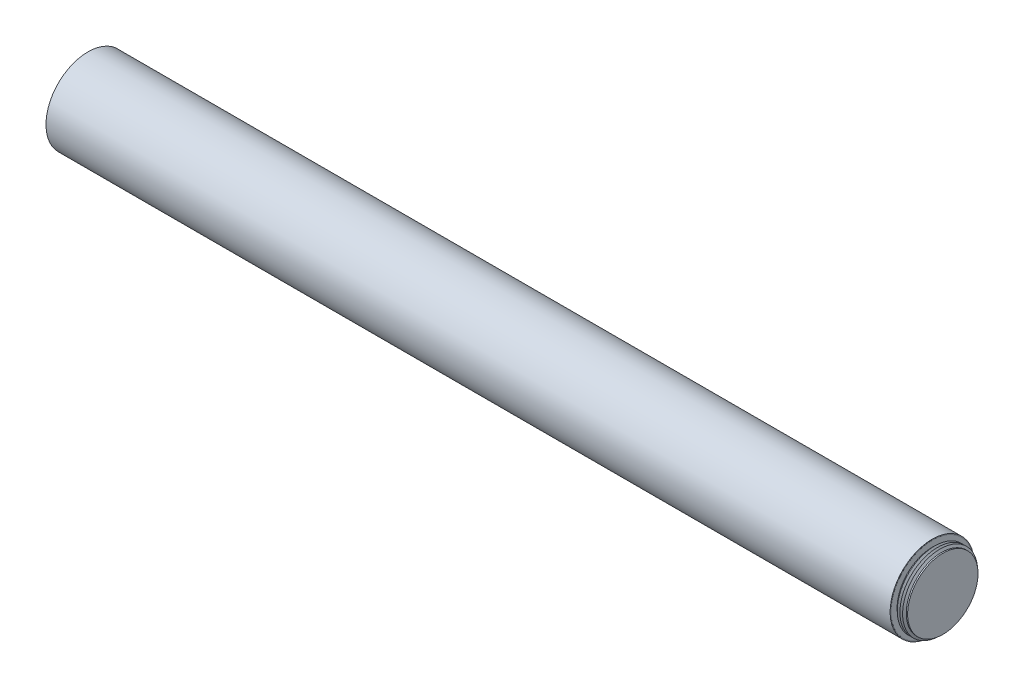
ISO-10303-21;
HEADER;
FILE_DESCRIPTION(('STEP AP214'),'2;1');
FILE_NAME('part.step','',(''),(''),'','','');
FILE_SCHEMA(('AUTOMOTIVE_DESIGN { 1 0 10303 214 1 1 1 1 }'));
ENDSEC;
DATA;
#1=APPLICATION_CONTEXT('core data for automotive mechanical design processes');
#2=APPLICATION_PROTOCOL_DEFINITION('international standard','automotive_design',2000,#1);
#3=PRODUCT_CONTEXT('',#1,'mechanical');
#4=PRODUCT('Part','Part','',(#3));
#5=PRODUCT_RELATED_PRODUCT_CATEGORY('part','',(#4));
#6=PRODUCT_DEFINITION_FORMATION('','',#4);
#7=PRODUCT_DEFINITION_CONTEXT('part definition',#1,'design');
#8=PRODUCT_DEFINITION('design','',#6,#7);
#9=PRODUCT_DEFINITION_SHAPE('','',#8);
#10=(LENGTH_UNIT() NAMED_UNIT(*) SI_UNIT(.MILLI.,.METRE.));
#11=(NAMED_UNIT(*) PLANE_ANGLE_UNIT() SI_UNIT($,.RADIAN.));
#12=(NAMED_UNIT(*) SI_UNIT($,.STERADIAN.) SOLID_ANGLE_UNIT());
#13=UNCERTAINTY_MEASURE_WITH_UNIT(LENGTH_MEASURE(1.E-05),#10,'distance_accuracy_value','');
#14=(GEOMETRIC_REPRESENTATION_CONTEXT(3) GLOBAL_UNCERTAINTY_ASSIGNED_CONTEXT((#13)) GLOBAL_UNIT_ASSIGNED_CONTEXT((#10,
#11,#12)) REPRESENTATION_CONTEXT('',''));
#15=CARTESIAN_POINT('',(0.,0.,0.));
#16=DIRECTION('',(0.,0.,1.));
#17=DIRECTION('',(1.,0.,0.));
#18=AXIS2_PLACEMENT_3D('',#15,#16,#17);
#19=CARTESIAN_POINT('',(-101.282037882411,-112.40761589404,6.95959679333066E-13));
#20=DIRECTION('',(1.,0.,0.));
#21=DIRECTION('',(0.,0.203317589338989,0.979112842253324));
#22=AXIS2_PLACEMENT_3D('',#19,#20,#21);
#23=PLANE('',#22);
#24=CARTESIAN_POINT('',(-101.282037882411,-112.40761589404,6.95959679333066E-13));
#25=DIRECTION('',(1.,0.,0.));
#26=DIRECTION('',(0.,0.203317589338989,0.979112842253324));
#27=AXIS2_PLACEMENT_3D('',#24,#25,#26);
#28=CIRCLE('',#27,49.784);
#29=CARTESIAN_POINT('',(-101.282037882411,-102.285653026388,48.7441537387402));
#30=VERTEX_POINT('',#29);
#31=EDGE_CURVE('E67',#30,#30,#28,.T.);
#32=ORIENTED_EDGE('',*,*,#31,.T.);
#33=EDGE_LOOP('',(#32));
#34=FACE_BOUND('',#33,.T.);
#35=CARTESIAN_POINT('',(-101.282037882411,-112.40761589404,8.14057642514373E-13));
#36=DIRECTION('',(1.,0.,0.));
#37=DIRECTION('',(0.,0.,-1.));
#38=AXIS2_PLACEMENT_3D('',#35,#36,#37);
#39=CIRCLE('',#38,48.8237923991094);
#40=CARTESIAN_POINT('',(-101.282037882411,-112.40761589404,-48.8237923991086));
#41=VERTEX_POINT('',#40);
#42=EDGE_CURVE('E18',#41,#41,#39,.T.);
#43=ORIENTED_EDGE('',*,*,#42,.F.);
#44=EDGE_LOOP('',(#43));
#45=FACE_BOUND('',#44,.T.);
#46=ADVANCED_FACE('F14',(#34,#45),#23,.T.);
#47=CARTESIAN_POINT('',(-1101.28003788241,-112.40761589404,1.74815006166353E-12));
#48=DIRECTION('',(1.,0.,0.));
#49=DIRECTION('',(0.,0.203317589338989,0.979112842253324));
#50=AXIS2_PLACEMENT_3D('',#47,#48,#49);
#51=PLANE('',#50);
#52=CARTESIAN_POINT('',(-1101.28003788241,-112.40761589404,1.74815006166353E-12));
#53=DIRECTION('',(1.,0.,0.));
#54=DIRECTION('',(0.,0.203317589338989,0.979112842253324));
#55=AXIS2_PLACEMENT_3D('',#52,#53,#54);
#56=CIRCLE('',#55,49.784);
#57=CARTESIAN_POINT('',(-1101.28003788241,-102.285653026388,48.7441537387412));
#58=VERTEX_POINT('',#57);
#59=EDGE_CURVE('E68',#58,#58,#56,.T.);
#60=ORIENTED_EDGE('',*,*,#59,.F.);
#61=EDGE_LOOP('',(#60));
#62=FACE_BOUND('',#61,.T.);
#63=CARTESIAN_POINT('',(-1101.28003788241,-112.40761589404,1.7372056179434E-12));
#64=DIRECTION('',(1.,0.,0.));
#65=DIRECTION('',(0.,0.,-1.));
#66=AXIS2_PLACEMENT_3D('',#63,#64,#65);
#67=CIRCLE('',#66,48.9203999999995);
#68=CARTESIAN_POINT('',(-1101.28003788241,-112.40761589404,-48.9203999999978));
#69=VERTEX_POINT('',#68);
#70=EDGE_CURVE('E64',#69,#69,#67,.F.);
#71=ORIENTED_EDGE('',*,*,#70,.F.);
#72=EDGE_LOOP('',(#71));
#73=FACE_BOUND('',#72,.T.);
#74=ADVANCED_FACE('F276',(#62,#73),#51,.F.);
#75=CARTESIAN_POINT('',(-101.282037882411,-112.40761589404,6.95959679333066E-13));
#76=DIRECTION('',(-1.,0.,0.));
#77=DIRECTION('',(0.,-0.203317589338989,-0.979112842253324));
#78=AXIS2_PLACEMENT_3D('',#75,#76,#77);
#79=CYLINDRICAL_SURFACE('',#78,49.784);
#80=ORIENTED_EDGE('',*,*,#31,.F.);
#81=EDGE_LOOP('',(#80));
#82=FACE_BOUND('',#81,.T.);
#83=ORIENTED_EDGE('',*,*,#59,.T.);
#84=EDGE_LOOP('',(#83));
#85=FACE_BOUND('',#84,.T.);
#86=ADVANCED_FACE('F283',(#82,#85),#79,.T.);
#87=CARTESIAN_POINT('',(-1101.28003788241,-112.40761589404,1.73030267499323E-12));
#88=DIRECTION('',(1.,0.,0.));
#89=DIRECTION('',(0.,0.999990910254518,-0.00426373173999859));
#90=AXIS2_PLACEMENT_3D('',#87,#88,#89);
#91=CIRCLE('',#90,44.45);
#92=CARTESIAN_POINT('',(-1101.28003788241,-67.9580199332265,-0.189522875841207));
#93=VERTEX_POINT('',#92);
#94=EDGE_CURVE('E155',#93,#93,#91,.T.);
#95=ORIENTED_EDGE('',*,*,#94,.T.);
#96=EDGE_LOOP('',(#95));
#97=FACE_BOUND('',#96,.T.);
#98=ORIENTED_EDGE('',*,*,#70,.T.);
#99=EDGE_LOOP('',(#98));
#100=FACE_BOUND('',#99,.T.);
#101=ADVANCED_FACE('F163',(#97,#100),#51,.F.);
#102=CARTESIAN_POINT('',(-101.114708609272,-112.40761589404,7.84938641112028E-13));
#103=DIRECTION('',(1.,0.,0.));
#104=DIRECTION('',(0.,0.,-1.));
#105=AXIS2_PLACEMENT_3D('',#102,#103,#104);
#106=CONICAL_SURFACE('',#105,48.9204,0.523598775598301);
#107=ORIENTED_EDGE('',*,*,#42,.T.);
#108=EDGE_LOOP('',(#107));
#109=FACE_BOUND('',#108,.T.);
#110=CARTESIAN_POINT('',(-101.114708609272,-112.40761589404,7.84938641112028E-13));
#111=DIRECTION('',(-1.,0.,0.));
#112=DIRECTION('',(0.,0.,1.));
#113=AXIS2_PLACEMENT_3D('',#110,#111,#112);
#114=CIRCLE('',#113,48.9204);
#115=CARTESIAN_POINT('',(-101.114708609272,-112.40761589404,48.9204000000008));
#116=VERTEX_POINT('',#115);
#117=EDGE_CURVE('E9',#116,#116,#114,.T.);
#118=ORIENTED_EDGE('',*,*,#117,.T.);
#119=EDGE_LOOP('',(#118));
#120=FACE_BOUND('',#119,.T.);
#121=ADVANCED_FACE('F16',(#109,#120),#106,.T.);
#122=CARTESIAN_POINT('',(-101.114708609272,-63.4872158940397,7.84938641112028E-13));
#123=DIRECTION('',(-1.,0.,0.));
#124=DIRECTION('',(0.,0.,1.));
#125=AXIS2_PLACEMENT_3D('',#122,#123,#124);
#126=PLANE('',#125);
#127=ORIENTED_EDGE('',*,*,#117,.F.);
#128=EDGE_LOOP('',(#127));
#129=FACE_BOUND('',#128,.T.);
#130=CARTESIAN_POINT('',(-101.114708609271,-112.40761589404,7.84938641112028E-13));
#131=DIRECTION('',(1.,0.,0.));
#132=DIRECTION('',(0.,0.,-1.));
#133=AXIS2_PLACEMENT_3D('',#130,#131,#132);
#134=CIRCLE('',#133,41.70035475);
#135=CARTESIAN_POINT('',(-101.114708609271,-112.40761589404,-41.7003547499992));
#136=VERTEX_POINT('',#135);
#137=EDGE_CURVE('E23',#136,#136,#134,.T.);
#138=ORIENTED_EDGE('',*,*,#137,.F.);
#139=EDGE_LOOP('',(#138));
#140=FACE_BOUND('',#139,.T.);
#141=ADVANCED_FACE('F329',(#129,#140),#126,.F.);
#142=CARTESIAN_POINT('',(-88.6687086092715,-67.9576158940398,7.84938641112028E-13));
#143=DIRECTION('',(-1.,0.,0.));
#144=DIRECTION('',(0.,0.,1.));
#145=AXIS2_PLACEMENT_3D('',#142,#143,#144);
#146=PLANE('',#145);
#147=CARTESIAN_POINT('',(-88.6687086092715,-112.40761589404,7.84938641112028E-13));
#148=DIRECTION('',(1.,0.,0.));
#149=DIRECTION('',(0.,0.,-1.));
#150=AXIS2_PLACEMENT_3D('',#147,#148,#149);
#151=CIRCLE('',#150,41.70035475);
#152=CARTESIAN_POINT('',(-88.6687086092715,-112.40761589404,-41.7003547499992));
#153=VERTEX_POINT('',#152);
#154=EDGE_CURVE('E60',#153,#153,#151,.T.);
#155=ORIENTED_EDGE('',*,*,#154,.T.);
#156=EDGE_LOOP('',(#155));
#157=FACE_BOUND('',#156,.T.);
#158=ADVANCED_FACE('F326',(#157),#146,.F.);
#159=CARTESIAN_POINT('',(-88.6687086092715,-112.40761589404,7.84938641112028E-13));
#160=DIRECTION('',(1.,0.,0.));
#161=DIRECTION('',(0.,0.,-1.));
#162=AXIS2_PLACEMENT_3D('',#159,#160,#161);
#163=CYLINDRICAL_SURFACE('',#162,41.70035475);
#164=CARTESIAN_POINT('',(-99.7812591608523,-112.40761589404,7.84938641112028E-13));
#165=DIRECTION('',(1.,0.,0.));
#166=DIRECTION('',(0.,0.,-1.));
#167=AXIS2_PLACEMENT_3D('',#164,#165,#166);
#168=CIRCLE('',#167,41.70035475);
#169=CARTESIAN_POINT('',(-99.7812591608523,-112.40761589404,-41.7003547499992));
#170=VERTEX_POINT('',#169);
#171=EDGE_CURVE('E30',#170,#170,#168,.T.);
#172=ORIENTED_EDGE('',*,*,#171,.F.);
#173=EDGE_LOOP('',(#172));
#174=FACE_BOUND('',#173,.T.);
#175=ORIENTED_EDGE('',*,*,#137,.T.);
#176=EDGE_LOOP('',(#175));
#177=FACE_BOUND('',#176,.T.);
#178=ADVANCED_FACE('F322',(#174,#177),#163,.T.);
#179=CARTESIAN_POINT('',(-99.7812591608523,-112.40761589404,7.84938641112028E-13));
#180=DIRECTION('',(1.,0.,0.));
#181=DIRECTION('',(0.,0.,-1.));
#182=AXIS2_PLACEMENT_3D('',#179,#180,#181);
#183=CONICAL_SURFACE('',#182,41.70035475,1.0471975511966);
#184=CARTESIAN_POINT('',(-98.1937507355888,-112.40761589404,7.84938641112028E-13));
#185=DIRECTION('',(1.,0.,0.));
#186=DIRECTION('',(0.,0.,-1.));
#187=AXIS2_PLACEMENT_3D('',#184,#185,#186);
#188=CIRCLE('',#187,44.45);
#189=CARTESIAN_POINT('',(-98.1937507355888,-112.40761589404,-44.4499999999992));
#190=VERTEX_POINT('',#189);
#191=EDGE_CURVE('E36',#190,#190,#188,.T.);
#192=ORIENTED_EDGE('',*,*,#191,.F.);
#193=EDGE_LOOP('',(#192));
#194=FACE_BOUND('',#193,.T.);
#195=ORIENTED_EDGE('',*,*,#171,.T.);
#196=EDGE_LOOP('',(#195));
#197=FACE_BOUND('',#196,.T.);
#198=ADVANCED_FACE('F318',(#194,#197),#183,.T.);
#199=CARTESIAN_POINT('',(-98.1937507355888,-112.40761589404,7.84938641112028E-13));
#200=DIRECTION('',(-1.,0.,0.));
#201=DIRECTION('',(0.,0.,1.));
#202=AXIS2_PLACEMENT_3D('',#199,#200,#201);
#203=CONICAL_SURFACE('',#202,44.45,1.0471975511966);
#204=CARTESIAN_POINT('',(-96.6062423103254,-112.40761589404,7.84938641112028E-13));
#205=DIRECTION('',(1.,0.,0.));
#206=DIRECTION('',(0.,0.,-1.));
#207=AXIS2_PLACEMENT_3D('',#204,#205,#206);
#208=CIRCLE('',#207,41.70035475);
#209=CARTESIAN_POINT('',(-96.6062423103254,-112.40761589404,-41.7003547499992));
#210=VERTEX_POINT('',#209);
#211=EDGE_CURVE('E40',#210,#210,#208,.T.);
#212=ORIENTED_EDGE('',*,*,#211,.F.);
#213=EDGE_LOOP('',(#212));
#214=FACE_BOUND('',#213,.T.);
#215=ORIENTED_EDGE('',*,*,#191,.T.);
#216=EDGE_LOOP('',(#215));
#217=FACE_BOUND('',#216,.T.);
#218=ADVANCED_FACE('F314',(#214,#217),#203,.T.);
#219=CARTESIAN_POINT('',(-96.6062423103254,-112.40761589404,7.84938641112028E-13));
#220=DIRECTION('',(1.,0.,0.));
#221=DIRECTION('',(0.,0.,-1.));
#222=AXIS2_PLACEMENT_3D('',#219,#220,#221);
#223=CONICAL_SURFACE('',#222,41.70035475,1.0471975511966);
#224=CARTESIAN_POINT('',(-95.0187338850619,-112.40761589404,7.84938641112028E-13));
#225=DIRECTION('',(1.,0.,0.));
#226=DIRECTION('',(0.,0.,-1.));
#227=AXIS2_PLACEMENT_3D('',#224,#225,#226);
#228=CIRCLE('',#227,44.45);
#229=CARTESIAN_POINT('',(-95.0187338850619,-112.40761589404,-44.4499999999992));
#230=VERTEX_POINT('',#229);
#231=EDGE_CURVE('E44',#230,#230,#228,.T.);
#232=ORIENTED_EDGE('',*,*,#231,.F.);
#233=EDGE_LOOP('',(#232));
#234=FACE_BOUND('',#233,.T.);
#235=ORIENTED_EDGE('',*,*,#211,.T.);
#236=EDGE_LOOP('',(#235));
#237=FACE_BOUND('',#236,.T.);
#238=ADVANCED_FACE('F310',(#234,#237),#223,.T.);
#239=CARTESIAN_POINT('',(-95.0187338850619,-112.40761589404,7.84938641112028E-13));
#240=DIRECTION('',(-1.,0.,0.));
#241=DIRECTION('',(0.,0.,1.));
#242=AXIS2_PLACEMENT_3D('',#239,#240,#241);
#243=CONICAL_SURFACE('',#242,44.45,1.0471975511966);
#244=CARTESIAN_POINT('',(-93.4312254597984,-112.40761589404,7.84938641112028E-13));
#245=DIRECTION('',(1.,0.,0.));
#246=DIRECTION('',(0.,0.,-1.));
#247=AXIS2_PLACEMENT_3D('',#244,#245,#246);
#248=CIRCLE('',#247,41.70035475);
#249=CARTESIAN_POINT('',(-93.4312254597984,-112.40761589404,-41.7003547499992));
#250=VERTEX_POINT('',#249);
#251=EDGE_CURVE('E48',#250,#250,#248,.T.);
#252=ORIENTED_EDGE('',*,*,#251,.F.);
#253=EDGE_LOOP('',(#252));
#254=FACE_BOUND('',#253,.T.);
#255=ORIENTED_EDGE('',*,*,#231,.T.);
#256=EDGE_LOOP('',(#255));
#257=FACE_BOUND('',#256,.T.);
#258=ADVANCED_FACE('F306',(#254,#257),#243,.T.);
#259=CARTESIAN_POINT('',(-93.4312254597984,-112.40761589404,7.84938641112028E-13));
#260=DIRECTION('',(1.,0.,0.));
#261=DIRECTION('',(0.,0.,-1.));
#262=AXIS2_PLACEMENT_3D('',#259,#260,#261);
#263=CONICAL_SURFACE('',#262,41.70035475,1.0471975511966);
#264=CARTESIAN_POINT('',(-91.843717034535,-112.40761589404,7.84938641112028E-13));
#265=DIRECTION('',(1.,0.,0.));
#266=DIRECTION('',(0.,0.,-1.));
#267=AXIS2_PLACEMENT_3D('',#264,#265,#266);
#268=CIRCLE('',#267,44.45);
#269=CARTESIAN_POINT('',(-91.843717034535,-112.40761589404,-44.4499999999992));
#270=VERTEX_POINT('',#269);
#271=EDGE_CURVE('E52',#270,#270,#268,.T.);
#272=ORIENTED_EDGE('',*,*,#271,.F.);
#273=EDGE_LOOP('',(#272));
#274=FACE_BOUND('',#273,.T.);
#275=ORIENTED_EDGE('',*,*,#251,.T.);
#276=EDGE_LOOP('',(#275));
#277=FACE_BOUND('',#276,.T.);
#278=ADVANCED_FACE('F302',(#274,#277),#263,.T.);
#279=CARTESIAN_POINT('',(-91.843717034535,-112.40761589404,7.84938641112028E-13));
#280=DIRECTION('',(-1.,0.,0.));
#281=DIRECTION('',(0.,0.,1.));
#282=AXIS2_PLACEMENT_3D('',#279,#280,#281);
#283=CONICAL_SURFACE('',#282,44.45,1.04719755119659);
#284=CARTESIAN_POINT('',(-90.2562086092715,-112.40761589404,7.84938641112028E-13));
#285=DIRECTION('',(1.,0.,0.));
#286=DIRECTION('',(0.,0.,-1.));
#287=AXIS2_PLACEMENT_3D('',#284,#285,#286);
#288=CIRCLE('',#287,41.70035475);
#289=CARTESIAN_POINT('',(-90.2562086092715,-112.40761589404,-41.7003547499992));
#290=VERTEX_POINT('',#289);
#291=EDGE_CURVE('E56',#290,#290,#288,.T.);
#292=ORIENTED_EDGE('',*,*,#291,.F.);
#293=EDGE_LOOP('',(#292));
#294=FACE_BOUND('',#293,.T.);
#295=ORIENTED_EDGE('',*,*,#271,.T.);
#296=EDGE_LOOP('',(#295));
#297=FACE_BOUND('',#296,.T.);
#298=ADVANCED_FACE('F298',(#294,#297),#283,.T.);
#299=CARTESIAN_POINT('',(-88.6687086092715,-112.40761589404,7.84938641112028E-13));
#300=DIRECTION('',(1.,0.,0.));
#301=DIRECTION('',(0.,0.,-1.));
#302=AXIS2_PLACEMENT_3D('',#299,#300,#301);
#303=CYLINDRICAL_SURFACE('',#302,41.70035475);
#304=ORIENTED_EDGE('',*,*,#154,.F.);
#305=EDGE_LOOP('',(#304));
#306=FACE_BOUND('',#305,.T.);
#307=ORIENTED_EDGE('',*,*,#291,.T.);
#308=EDGE_LOOP('',(#307));
#309=FACE_BOUND('',#308,.T.);
#310=ADVANCED_FACE('F295',(#306,#309),#303,.T.);
#311=CARTESIAN_POINT('',(-1056.57603788241,-112.40761589404,1.53249278601361E-12));
#312=DIRECTION('',(-1.,0.,0.));
#313=DIRECTION('',(0.,0.,1.));
#314=AXIS2_PLACEMENT_3D('',#311,#312,#313);
#315=PLANE('',#314);
#316=CARTESIAN_POINT('',(-1056.57603788241,-112.40761589404,1.53249278601361E-12));
#317=DIRECTION('',(-1.,0.,0.));
#318=DIRECTION('',(0.,-0.999990910254518,0.00426373173999859));
#319=AXIS2_PLACEMENT_3D('',#316,#317,#318);
#320=CIRCLE('',#319,36.449);
#321=CARTESIAN_POINT('',(-1056.57603788241,-148.856284581907,0.155408758192741));
#322=VERTEX_POINT('',#321);
#323=EDGE_CURVE('E151',#322,#322,#320,.T.);
#324=ORIENTED_EDGE('',*,*,#323,.T.);
#325=EDGE_LOOP('',(#324));
#326=FACE_BOUND('',#325,.T.);
#327=ADVANCED_FACE('F288',(#326),#315,.T.);
#328=CARTESIAN_POINT('',(-1058.10003788241,-112.40761589404,1.60323875006586E-12));
#329=DIRECTION('',(1.,0.,0.));
#330=DIRECTION('',(0.,0.999990910254518,-0.00426373173999859));
#331=AXIS2_PLACEMENT_3D('',#328,#329,#330);
#332=CONICAL_SURFACE('',#331,34.925,0.785398163397451);
#333=ORIENTED_EDGE('',*,*,#323,.F.);
#334=EDGE_LOOP('',(#333));
#335=FACE_BOUND('',#334,.T.);
#336=CARTESIAN_POINT('',(-1058.10003788241,-112.40761589404,1.60323875006586E-12));
#337=DIRECTION('',(-1.,0.,0.));
#338=DIRECTION('',(0.,-0.999990910254518,0.00426373173999859));
#339=AXIS2_PLACEMENT_3D('',#336,#337,#338);
#340=CIRCLE('',#339,34.925);
#341=CARTESIAN_POINT('',(-1058.10003788241,-147.332298434679,0.148910831021054));
#342=VERTEX_POINT('',#341);
#343=EDGE_CURVE('E143',#342,#342,#340,.F.);
#344=ORIENTED_EDGE('',*,*,#343,.F.);
#345=EDGE_LOOP('',(#344));
#346=FACE_BOUND('',#345,.T.);
#347=ADVANCED_FACE('F170',(#335,#346),#332,.F.);
#348=CARTESIAN_POINT('',(-1101.28003788241,-112.40761589404,1.73030267499323E-12));
#349=DIRECTION('',(1.,0.,0.));
#350=DIRECTION('',(0.,0.999990910254518,-0.00426373173999859));
#351=AXIS2_PLACEMENT_3D('',#348,#349,#350);
#352=CYLINDRICAL_SURFACE('',#351,44.45);
#353=ORIENTED_EDGE('',*,*,#94,.F.);
#354=EDGE_LOOP('',(#353));
#355=FACE_BOUND('',#354,.T.);
#356=CARTESIAN_POINT('',(-1099.50203788241,-112.40761589404,1.72859409174999E-12));
#357=DIRECTION('',(1.,0.,0.));
#358=DIRECTION('',(0.,0.999990910254518,-0.00426373173999859));
#359=AXIS2_PLACEMENT_3D('',#356,#357,#358);
#360=CIRCLE('',#359,44.45);
#361=CARTESIAN_POINT('',(-1099.50203788241,-67.9580199332265,-0.189522875841209));
#362=VERTEX_POINT('',#361);
#363=EDGE_CURVE('E72',#362,#362,#360,.T.);
#364=ORIENTED_EDGE('',*,*,#363,.T.);
#365=EDGE_LOOP('',(#364));
#366=FACE_BOUND('',#365,.T.);
#367=ADVANCED_FACE('F166',(#355,#366),#352,.F.);
#368=CARTESIAN_POINT('',(-1097.91452945715,-112.40761589404,1.72747900816271E-12));
#369=DIRECTION('',(-1.,0.,0.));
#370=DIRECTION('',(0.,-0.999990910254518,0.00426373173999859));
#371=AXIS2_PLACEMENT_3D('',#368,#369,#370);
#372=CONICAL_SURFACE('',#371,41.70035475,1.0471975511966);
#373=ORIENTED_EDGE('',*,*,#363,.F.);
#374=EDGE_LOOP('',(#373));
#375=FACE_BOUND('',#374,.T.);
#376=CARTESIAN_POINT('',(-1097.91452945715,-112.40761589404,1.72747900816271E-12));
#377=DIRECTION('',(1.,0.,0.));
#378=DIRECTION('',(0.,0.999990910254518,-0.00426373173999859));
#379=AXIS2_PLACEMENT_3D('',#376,#377,#378);
#380=CIRCLE('',#379,41.70035475);
#381=CARTESIAN_POINT('',(-1097.91452945715,-70.707640189651,-0.177799126115049));
#382=VERTEX_POINT('',#381);
#383=EDGE_CURVE('E79',#382,#382,#380,.T.);
#384=ORIENTED_EDGE('',*,*,#383,.T.);
#385=EDGE_LOOP('',(#384));
#386=FACE_BOUND('',#385,.T.);
#387=ADVANCED_FACE('F169',(#375,#386),#372,.F.);
#388=CARTESIAN_POINT('',(-1096.32702103189,-112.40761589404,1.72593024764849E-12));
#389=DIRECTION('',(1.,0.,0.));
#390=DIRECTION('',(0.,0.999990910254518,-0.00426373173999859));
#391=AXIS2_PLACEMENT_3D('',#388,#389,#390);
#392=CONICAL_SURFACE('',#391,44.45,1.04719755119659);
#393=ORIENTED_EDGE('',*,*,#383,.F.);
#394=EDGE_LOOP('',(#393));
#395=FACE_BOUND('',#394,.T.);
#396=CARTESIAN_POINT('',(-1096.32702103189,-112.40761589404,1.72593024764849E-12));
#397=DIRECTION('',(1.,0.,0.));
#398=DIRECTION('',(0.,0.999990910254518,-0.00426373173999859));
#399=AXIS2_PLACEMENT_3D('',#396,#397,#398);
#400=CIRCLE('',#399,44.45);
#401=CARTESIAN_POINT('',(-1096.32702103189,-67.9580199332265,-0.189522875841211));
#402=VERTEX_POINT('',#401);
#403=EDGE_CURVE('E83',#402,#402,#400,.T.);
#404=ORIENTED_EDGE('',*,*,#403,.T.);
#405=EDGE_LOOP('',(#404));
#406=FACE_BOUND('',#405,.T.);
#407=ADVANCED_FACE('F176',(#395,#406),#392,.F.);
#408=CARTESIAN_POINT('',(-1094.73951681924,-112.40761589404,1.72459832913213E-12));
#409=DIRECTION('',(-1.,0.,0.));
#410=DIRECTION('',(0.,-0.999990910254518,0.00426373173999859));
#411=AXIS2_PLACEMENT_3D('',#408,#409,#410);
#412=CONICAL_SURFACE('',#411,41.7003620464632,1.0471975511966);
#413=ORIENTED_EDGE('',*,*,#403,.F.);
#414=EDGE_LOOP('',(#413));
#415=FACE_BOUND('',#414,.T.);
#416=CARTESIAN_POINT('',(-1094.73951681924,-112.40761589404,1.72459832913213E-12));
#417=DIRECTION('',(1.,0.,0.));
#418=DIRECTION('',(0.,0.999990910254518,-0.00426373173999859));
#419=AXIS2_PLACEMENT_3D('',#416,#417,#418);
#420=CIRCLE('',#419,41.7003620464632);
#421=CARTESIAN_POINT('',(-1094.73951681924,-70.7076328932542,-0.177799157225213));
#422=VERTEX_POINT('',#421);
#423=EDGE_CURVE('E87',#422,#422,#420,.T.);
#424=ORIENTED_EDGE('',*,*,#423,.T.);
#425=EDGE_LOOP('',(#424));
#426=FACE_BOUND('',#425,.T.);
#427=ADVANCED_FACE('F182',(#415,#426),#412,.F.);
#428=CARTESIAN_POINT('',(-1093.15200839397,-112.40761589404,1.72326640708138E-12));
#429=DIRECTION('',(1.,0.,0.));
#430=DIRECTION('',(0.,0.999990910254518,-0.00426373173999859));
#431=AXIS2_PLACEMENT_3D('',#428,#429,#430);
#432=CONICAL_SURFACE('',#431,44.4500072964631,1.04719755119659);
#433=ORIENTED_EDGE('',*,*,#423,.F.);
#434=EDGE_LOOP('',(#433));
#435=FACE_BOUND('',#434,.T.);
#436=CARTESIAN_POINT('',(-1093.15200839397,-112.40761589404,1.72326640708138E-12));
#437=DIRECTION('',(1.,0.,0.));
#438=DIRECTION('',(0.,0.999990910254518,-0.00426373173999859));
#439=AXIS2_PLACEMENT_3D('',#436,#437,#438);
#440=CIRCLE('',#439,44.4500072964631);
#441=CARTESIAN_POINT('',(-1093.15200839397,-67.9580126368297,-0.189522906951376));
#442=VERTEX_POINT('',#441);
#443=EDGE_CURVE('E91',#442,#442,#440,.T.);
#444=ORIENTED_EDGE('',*,*,#443,.T.);
#445=EDGE_LOOP('',(#444));
#446=FACE_BOUND('',#445,.T.);
#447=ADVANCED_FACE('F188',(#435,#446),#432,.F.);
#448=CARTESIAN_POINT('',(-1091.56450418132,-112.40761589404,1.72193448856503E-12));
#449=DIRECTION('',(-1.,0.,0.));
#450=DIRECTION('',(0.,-0.999990910254518,0.00426373173999859));
#451=AXIS2_PLACEMENT_3D('',#448,#449,#450);
#452=CONICAL_SURFACE('',#451,41.7003693429263,1.0471975511966);
#453=ORIENTED_EDGE('',*,*,#443,.F.);
#454=EDGE_LOOP('',(#453));
#455=FACE_BOUND('',#454,.T.);
#456=CARTESIAN_POINT('',(-1091.56450418132,-112.40761589404,1.72193448856503E-12));
#457=DIRECTION('',(1.,0.,0.));
#458=DIRECTION('',(0.,0.999990910254518,-0.00426373173999859));
#459=AXIS2_PLACEMENT_3D('',#456,#457,#458);
#460=CIRCLE('',#459,41.7003693429263);
#461=CARTESIAN_POINT('',(-1091.56450418132,-70.7076255968573,-0.177799188335377));
#462=VERTEX_POINT('',#461);
#463=EDGE_CURVE('E95',#462,#462,#460,.T.);
#464=ORIENTED_EDGE('',*,*,#463,.T.);
#465=EDGE_LOOP('',(#464));
#466=FACE_BOUND('',#465,.T.);
#467=ADVANCED_FACE('F194',(#455,#466),#452,.F.);
#468=CARTESIAN_POINT('',(-1089.97699575606,-112.40761589404,1.72060256651428E-12));
#469=DIRECTION('',(1.,0.,0.));
#470=DIRECTION('',(0.,0.999990910254518,-0.00426373173999859));
#471=AXIS2_PLACEMENT_3D('',#468,#469,#470);
#472=CONICAL_SURFACE('',#471,44.4500145929263,1.04719755119659);
#473=ORIENTED_EDGE('',*,*,#463,.F.);
#474=EDGE_LOOP('',(#473));
#475=FACE_BOUND('',#474,.T.);
#476=CARTESIAN_POINT('',(-1089.97699575606,-112.40761589404,1.72060256651428E-12));
#477=DIRECTION('',(1.,0.,0.));
#478=DIRECTION('',(0.,0.999990910254518,-0.00426373173999859));
#479=AXIS2_PLACEMENT_3D('',#476,#477,#478);
#480=CIRCLE('',#479,44.4500145929263);
#481=CARTESIAN_POINT('',(-1089.97699575606,-67.9580053404328,-0.18952293806154));
#482=VERTEX_POINT('',#481);
#483=EDGE_CURVE('E99',#482,#482,#480,.T.);
#484=ORIENTED_EDGE('',*,*,#483,.T.);
#485=EDGE_LOOP('',(#484));
#486=FACE_BOUND('',#485,.T.);
#487=ADVANCED_FACE('F200',(#475,#486),#472,.F.);
#488=CARTESIAN_POINT('',(-1088.38949154341,-112.40761589404,1.71927064799792E-12));
#489=DIRECTION('',(-1.,0.,0.));
#490=DIRECTION('',(0.,-0.999990910254518,0.00426373173999859));
#491=AXIS2_PLACEMENT_3D('',#488,#489,#490);
#492=CONICAL_SURFACE('',#491,41.7003766393895,1.0471975511966);
#493=ORIENTED_EDGE('',*,*,#483,.F.);
#494=EDGE_LOOP('',(#493));
#495=FACE_BOUND('',#494,.T.);
#496=CARTESIAN_POINT('',(-1088.38949154341,-112.40761589404,1.71927064799792E-12));
#497=DIRECTION('',(1.,0.,0.));
#498=DIRECTION('',(0.,0.999990910254518,-0.00426373173999859));
#499=AXIS2_PLACEMENT_3D('',#496,#497,#498);
#500=CIRCLE('',#499,41.7003766393895);
#501=CARTESIAN_POINT('',(-1088.38949154341,-70.7076183004605,-0.177799219445542));
#502=VERTEX_POINT('',#501);
#503=EDGE_CURVE('E103',#502,#502,#500,.T.);
#504=ORIENTED_EDGE('',*,*,#503,.T.);
#505=EDGE_LOOP('',(#504));
#506=FACE_BOUND('',#505,.T.);
#507=ADVANCED_FACE('F206',(#495,#506),#492,.F.);
#508=CARTESIAN_POINT('',(-1086.80198311815,-112.40761589404,1.71793872594717E-12));
#509=DIRECTION('',(1.,0.,0.));
#510=DIRECTION('',(0.,0.999990910254518,-0.00426373173999859));
#511=AXIS2_PLACEMENT_3D('',#508,#509,#510);
#512=CONICAL_SURFACE('',#511,44.4500218893895,1.04719755119659);
#513=ORIENTED_EDGE('',*,*,#503,.F.);
#514=EDGE_LOOP('',(#513));
#515=FACE_BOUND('',#514,.T.);
#516=CARTESIAN_POINT('',(-1086.80198311815,-112.40761589404,1.71793872594717E-12));
#517=DIRECTION('',(1.,0.,0.));
#518=DIRECTION('',(0.,0.999990910254518,-0.00426373173999859));
#519=AXIS2_PLACEMENT_3D('',#516,#517,#518);
#520=CIRCLE('',#519,44.4500218893895);
#521=CARTESIAN_POINT('',(-1086.80198311815,-67.957998044036,-0.189522969171704));
#522=VERTEX_POINT('',#521);
#523=EDGE_CURVE('E107',#522,#522,#520,.T.);
#524=ORIENTED_EDGE('',*,*,#523,.T.);
#525=EDGE_LOOP('',(#524));
#526=FACE_BOUND('',#525,.T.);
#527=ADVANCED_FACE('F212',(#515,#526),#512,.F.);
#528=CARTESIAN_POINT('',(-1085.2144789055,-112.40761589404,1.71660680743082E-12));
#529=DIRECTION('',(-1.,0.,0.));
#530=DIRECTION('',(0.,-0.999990910254518,0.00426373173999859));
#531=AXIS2_PLACEMENT_3D('',#528,#529,#530);
#532=CONICAL_SURFACE('',#531,41.7003839358526,1.0471975511966);
#533=ORIENTED_EDGE('',*,*,#523,.F.);
#534=EDGE_LOOP('',(#533));
#535=FACE_BOUND('',#534,.T.);
#536=CARTESIAN_POINT('',(-1085.2144789055,-112.40761589404,1.71660680743082E-12));
#537=DIRECTION('',(1.,0.,0.));
#538=DIRECTION('',(0.,0.999990910254518,-0.00426373173999859));
#539=AXIS2_PLACEMENT_3D('',#536,#537,#538);
#540=CIRCLE('',#539,41.7003839358526);
#541=CARTESIAN_POINT('',(-1085.2144789055,-70.7076110040637,-0.177799250555706));
#542=VERTEX_POINT('',#541);
#543=EDGE_CURVE('E111',#542,#542,#540,.T.);
#544=ORIENTED_EDGE('',*,*,#543,.T.);
#545=EDGE_LOOP('',(#544));
#546=FACE_BOUND('',#545,.T.);
#547=ADVANCED_FACE('F218',(#535,#546),#532,.F.);
#548=CARTESIAN_POINT('',(-1083.62697048024,-112.40761589404,1.71527488538007E-12));
#549=DIRECTION('',(1.,0.,0.));
#550=DIRECTION('',(0.,0.999990910254518,-0.00426373173999859));
#551=AXIS2_PLACEMENT_3D('',#548,#549,#550);
#552=CONICAL_SURFACE('',#551,44.4500291858527,1.04719755119659);
#553=ORIENTED_EDGE('',*,*,#543,.F.);
#554=EDGE_LOOP('',(#553));
#555=FACE_BOUND('',#554,.T.);
#556=CARTESIAN_POINT('',(-1083.62697048024,-112.40761589404,1.71527488538007E-12));
#557=DIRECTION('',(1.,0.,0.));
#558=DIRECTION('',(0.,0.999990910254518,-0.00426373173999859));
#559=AXIS2_PLACEMENT_3D('',#556,#557,#558);
#560=CIRCLE('',#559,44.4500291858527);
#561=CARTESIAN_POINT('',(-1083.62697048024,-67.9579907476391,-0.189523000281869));
#562=VERTEX_POINT('',#561);
#563=EDGE_CURVE('E115',#562,#562,#560,.T.);
#564=ORIENTED_EDGE('',*,*,#563,.T.);
#565=EDGE_LOOP('',(#564));
#566=FACE_BOUND('',#565,.T.);
#567=ADVANCED_FACE('F224',(#555,#566),#552,.F.);
#568=CARTESIAN_POINT('',(-1082.03946626759,-112.40761589404,1.71394296686371E-12));
#569=DIRECTION('',(-1.,0.,0.));
#570=DIRECTION('',(0.,-0.999990910254518,0.00426373173999859));
#571=AXIS2_PLACEMENT_3D('',#568,#569,#570);
#572=CONICAL_SURFACE('',#571,41.7003912323158,1.0471975511966);
#573=ORIENTED_EDGE('',*,*,#563,.F.);
#574=EDGE_LOOP('',(#573));
#575=FACE_BOUND('',#574,.T.);
#576=CARTESIAN_POINT('',(-1082.03946626759,-112.40761589404,1.71394296686371E-12));
#577=DIRECTION('',(1.,0.,0.));
#578=DIRECTION('',(0.,0.999990910254518,-0.00426373173999859));
#579=AXIS2_PLACEMENT_3D('',#576,#577,#578);
#580=CIRCLE('',#579,41.7003912323158);
#581=CARTESIAN_POINT('',(-1082.03946626759,-70.7076037076668,-0.17779928166587));
#582=VERTEX_POINT('',#581);
#583=EDGE_CURVE('E119',#582,#582,#580,.T.);
#584=ORIENTED_EDGE('',*,*,#583,.T.);
#585=EDGE_LOOP('',(#584));
#586=FACE_BOUND('',#585,.T.);
#587=ADVANCED_FACE('F230',(#575,#586),#572,.F.);
#588=CARTESIAN_POINT('',(-1080.45195784233,-112.40761589404,1.71261104481296E-12));
#589=DIRECTION('',(1.,0.,0.));
#590=DIRECTION('',(0.,0.999990910254518,-0.00426373173999859));
#591=AXIS2_PLACEMENT_3D('',#588,#589,#590);
#592=CONICAL_SURFACE('',#591,44.4500364823158,1.04719755119659);
#593=ORIENTED_EDGE('',*,*,#583,.F.);
#594=EDGE_LOOP('',(#593));
#595=FACE_BOUND('',#594,.T.);
#596=CARTESIAN_POINT('',(-1080.45195784233,-112.40761589404,1.71261104481296E-12));
#597=DIRECTION('',(1.,0.,0.));
#598=DIRECTION('',(0.,0.999990910254518,-0.00426373173999859));
#599=AXIS2_PLACEMENT_3D('',#596,#597,#598);
#600=CIRCLE('',#599,44.4500364823158);
#601=CARTESIAN_POINT('',(-1080.45195784233,-67.9579834512423,-0.189523031392033));
#602=VERTEX_POINT('',#601);
#603=EDGE_CURVE('E123',#602,#602,#600,.T.);
#604=ORIENTED_EDGE('',*,*,#603,.T.);
#605=EDGE_LOOP('',(#604));
#606=FACE_BOUND('',#605,.T.);
#607=ADVANCED_FACE('F236',(#595,#606),#592,.F.);
#608=CARTESIAN_POINT('',(-1078.86445362968,-112.40761589404,1.71127912629661E-12));
#609=DIRECTION('',(-1.,0.,0.));
#610=DIRECTION('',(0.,-0.999990910254518,0.00426373173999859));
#611=AXIS2_PLACEMENT_3D('',#608,#609,#610);
#612=CONICAL_SURFACE('',#611,41.700398528779,1.0471975511966);
#613=ORIENTED_EDGE('',*,*,#603,.F.);
#614=EDGE_LOOP('',(#613));
#615=FACE_BOUND('',#614,.T.);
#616=CARTESIAN_POINT('',(-1078.86445362968,-112.40761589404,1.71127912629661E-12));
#617=DIRECTION('',(1.,0.,0.));
#618=DIRECTION('',(0.,0.999990910254518,-0.00426373173999859));
#619=AXIS2_PLACEMENT_3D('',#616,#617,#618);
#620=CIRCLE('',#619,41.700398528779);
#621=CARTESIAN_POINT('',(-1078.86445362968,-70.70759641127,-0.177799312776034));
#622=VERTEX_POINT('',#621);
#623=EDGE_CURVE('E127',#622,#622,#620,.T.);
#624=ORIENTED_EDGE('',*,*,#623,.T.);
#625=EDGE_LOOP('',(#624));
#626=FACE_BOUND('',#625,.T.);
#627=ADVANCED_FACE('F242',(#615,#626),#612,.F.);
#628=CARTESIAN_POINT('',(-1077.27694520441,-112.40761589404,1.70994720424586E-12));
#629=DIRECTION('',(1.,0.,0.));
#630=DIRECTION('',(0.,0.999990910254518,-0.00426373173999859));
#631=AXIS2_PLACEMENT_3D('',#628,#629,#630);
#632=CONICAL_SURFACE('',#631,44.450043778779,1.04719755119659);
#633=ORIENTED_EDGE('',*,*,#623,.F.);
#634=EDGE_LOOP('',(#633));
#635=FACE_BOUND('',#634,.T.);
#636=CARTESIAN_POINT('',(-1077.27694520441,-112.40761589404,1.70994720424586E-12));
#637=DIRECTION('',(1.,0.,0.));
#638=DIRECTION('',(0.,0.999990910254518,-0.00426373173999859));
#639=AXIS2_PLACEMENT_3D('',#636,#637,#638);
#640=CIRCLE('',#639,44.450043778779);
#641=CARTESIAN_POINT('',(-1077.27694520441,-67.9579761548455,-0.189523062502197));
#642=VERTEX_POINT('',#641);
#643=EDGE_CURVE('E131',#642,#642,#640,.T.);
#644=ORIENTED_EDGE('',*,*,#643,.T.);
#645=EDGE_LOOP('',(#644));
#646=FACE_BOUND('',#645,.T.);
#647=ADVANCED_FACE('F248',(#635,#646),#632,.F.);
#648=CARTESIAN_POINT('',(-1101.28003788241,-112.40761589404,1.73030267499323E-12));
#649=DIRECTION('',(1.,0.,0.));
#650=DIRECTION('',(0.,0.999990910254518,-0.00426373173999859));
#651=AXIS2_PLACEMENT_3D('',#648,#649,#650);
#652=CYLINDRICAL_SURFACE('',#651,44.450043778779);
#653=ORIENTED_EDGE('',*,*,#643,.F.);
#654=EDGE_LOOP('',(#653));
#655=FACE_BOUND('',#654,.T.);
#656=CARTESIAN_POINT('',(-1075.62603788241,-112.40761589404,1.70856209042163E-12));
#657=DIRECTION('',(1.,0.,0.));
#658=DIRECTION('',(0.,0.999990910254518,-0.00426373173999859));
#659=AXIS2_PLACEMENT_3D('',#656,#657,#658);
#660=CIRCLE('',#659,44.450043778779);
#661=CARTESIAN_POINT('',(-1075.62603788241,-67.9579761548455,-0.189523062502198));
#662=VERTEX_POINT('',#661);
#663=EDGE_CURVE('E135',#662,#662,#660,.T.);
#664=ORIENTED_EDGE('',*,*,#663,.T.);
#665=EDGE_LOOP('',(#664));
#666=FACE_BOUND('',#665,.T.);
#667=ADVANCED_FACE('F254',(#655,#666),#652,.F.);
#668=CARTESIAN_POINT('',(-1075.62603788241,-112.40761589404,1.70856209042163E-12));
#669=DIRECTION('',(-1.,0.,0.));
#670=DIRECTION('',(0.,-0.999990910254518,0.00426373173999859));
#671=AXIS2_PLACEMENT_3D('',#668,#669,#670);
#672=PLANE('',#671);
#673=CARTESIAN_POINT('',(-1075.62603788241,-112.40761589404,1.70856209042163E-12));
#674=DIRECTION('',(-1.,0.,0.));
#675=DIRECTION('',(0.,-0.999990910254518,0.00426373173999859));
#676=AXIS2_PLACEMENT_3D('',#673,#674,#675);
#677=CIRCLE('',#676,36.449);
#678=CARTESIAN_POINT('',(-1075.62603788241,-148.856284581907,0.155408758192917));
#679=VERTEX_POINT('',#678);
#680=EDGE_CURVE('E139',#679,#679,#677,.F.);
#681=ORIENTED_EDGE('',*,*,#680,.T.);
#682=EDGE_LOOP('',(#681));
#683=FACE_BOUND('',#682,.T.);
#684=ORIENTED_EDGE('',*,*,#663,.F.);
#685=EDGE_LOOP('',(#684));
#686=FACE_BOUND('',#685,.T.);
#687=ADVANCED_FACE('F260',(#683,#686),#672,.T.);
#688=CARTESIAN_POINT('',(-1075.62603788241,-112.40761589404,1.70856209042163E-12));
#689=DIRECTION('',(-1.,0.,0.));
#690=DIRECTION('',(0.,-0.999990910254518,0.00426373173999859));
#691=AXIS2_PLACEMENT_3D('',#688,#689,#690);
#692=CONICAL_SURFACE('',#691,36.449,0.785398163397447);
#693=CARTESIAN_POINT('',(-1074.10203788241,-112.40761589404,1.70728345203897E-12));
#694=DIRECTION('',(-1.,0.,0.));
#695=DIRECTION('',(0.,-0.999990910254518,0.00426373173999859));
#696=AXIS2_PLACEMENT_3D('',#693,#694,#695);
#697=CIRCLE('',#696,34.925);
#698=CARTESIAN_POINT('',(-1074.10203788241,-147.332298434679,0.148910831021158));
#699=VERTEX_POINT('',#698);
#700=EDGE_CURVE('E147',#699,#699,#697,.T.);
#701=ORIENTED_EDGE('',*,*,#700,.F.);
#702=EDGE_LOOP('',(#701));
#703=FACE_BOUND('',#702,.T.);
#704=ORIENTED_EDGE('',*,*,#680,.F.);
#705=EDGE_LOOP('',(#704));
#706=FACE_BOUND('',#705,.T.);
#707=ADVANCED_FACE('F265',(#703,#706),#692,.F.);
#708=CARTESIAN_POINT('',(-1101.28003788241,-112.40761589404,1.73030267499323E-12));
#709=DIRECTION('',(1.,0.,0.));
#710=DIRECTION('',(0.,0.999990910254518,-0.00426373173999859));
#711=AXIS2_PLACEMENT_3D('',#708,#709,#710);
#712=CYLINDRICAL_SURFACE('',#711,34.925);
#713=ORIENTED_EDGE('',*,*,#700,.T.);
#714=EDGE_LOOP('',(#713));
#715=FACE_BOUND('',#714,.T.);
#716=ORIENTED_EDGE('',*,*,#343,.T.);
#717=EDGE_LOOP('',(#716));
#718=FACE_BOUND('',#717,.T.);
#719=ADVANCED_FACE('F272',(#715,#718),#712,.F.);
#720=CLOSED_SHELL('',(#46,#74,#86,#101,#121,#141,#158,#178,#198,#218,#238,#258,#278,#298,#310,
#327,#347,#367,#387,#407,#427,#447,#467,#487,#507,#527,#547,#567,#587,#607,#627,#647,#667,#687,
#707,#719));
#721=MANIFOLD_SOLID_BREP('B1',#720);
#722=ADVANCED_BREP_SHAPE_REPRESENTATION('',(#18,#721),#14);
#723=SHAPE_DEFINITION_REPRESENTATION(#9,#722);
ENDSEC;
END-ISO-10303-21;
